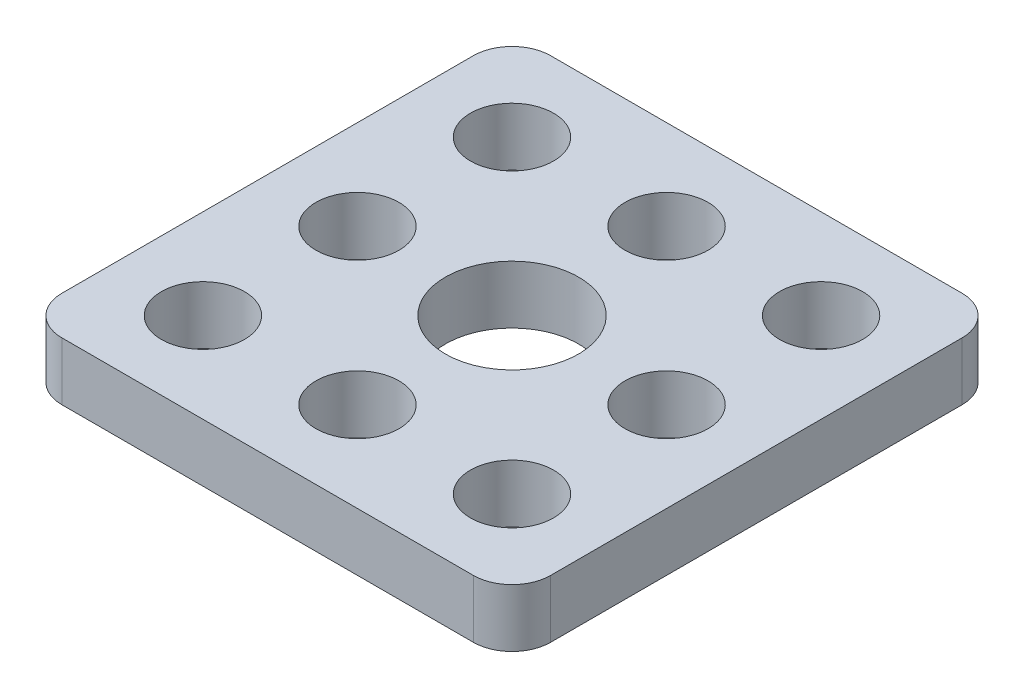
ISO-10303-21;
HEADER;
FILE_DESCRIPTION(('STEP AP214'),'2;1');
FILE_NAME('part.step','',(''),(''),'','','');
FILE_SCHEMA(('AUTOMOTIVE_DESIGN { 1 0 10303 214 1 1 1 1 }'));
ENDSEC;
DATA;
#1=APPLICATION_CONTEXT('core data for automotive mechanical design processes');
#2=APPLICATION_PROTOCOL_DEFINITION('international standard','automotive_design',2000,#1);
#3=PRODUCT_CONTEXT('',#1,'mechanical');
#4=PRODUCT('Part','Part','',(#3));
#5=PRODUCT_RELATED_PRODUCT_CATEGORY('part','',(#4));
#6=PRODUCT_DEFINITION_FORMATION('','',#4);
#7=PRODUCT_DEFINITION_CONTEXT('part definition',#1,'design');
#8=PRODUCT_DEFINITION('design','',#6,#7);
#9=PRODUCT_DEFINITION_SHAPE('','',#8);
#10=(LENGTH_UNIT() NAMED_UNIT(*) SI_UNIT(.MILLI.,.METRE.));
#11=(NAMED_UNIT(*) PLANE_ANGLE_UNIT() SI_UNIT($,.RADIAN.));
#12=(NAMED_UNIT(*) SI_UNIT($,.STERADIAN.) SOLID_ANGLE_UNIT());
#13=UNCERTAINTY_MEASURE_WITH_UNIT(LENGTH_MEASURE(1.E-05),#10,'distance_accuracy_value','');
#14=(GEOMETRIC_REPRESENTATION_CONTEXT(3) GLOBAL_UNCERTAINTY_ASSIGNED_CONTEXT((#13)) GLOBAL_UNIT_ASSIGNED_CONTEXT((#10,
#11,#12)) REPRESENTATION_CONTEXT('',''));
#15=CARTESIAN_POINT('',(0.,0.,0.));
#16=DIRECTION('',(0.,0.,1.));
#17=DIRECTION('',(1.,0.,0.));
#18=AXIS2_PLACEMENT_3D('',#15,#16,#17);
#19=CARTESIAN_POINT('',(0.,3.,0.));
#20=DIRECTION('',(0.,-1.,0.));
#21=DIRECTION('',(0.,0.,-1.));
#22=AXIS2_PLACEMENT_3D('',#19,#20,#21);
#23=PLANE('',#22);
#24=DIRECTION('',(-1.,0.,0.));
#25=VECTOR('',#24,1.);
#26=CARTESIAN_POINT('',(0.,3.,-25.3));
#27=LINE('',#26,#25);
#28=CARTESIAN_POINT('',(23.3,3.,-25.3));
#29=VERTEX_POINT('',#28);
#30=CARTESIAN_POINT('',(2.,3.,-25.3));
#31=VERTEX_POINT('',#30);
#32=EDGE_CURVE('E138',#29,#31,#27,.T.);
#33=ORIENTED_EDGE('',*,*,#32,.T.);
#34=CARTESIAN_POINT('',(2.,3.,-23.3));
#35=DIRECTION('',(0.,-1.,0.));
#36=DIRECTION('',(0.,0.,-1.));
#37=AXIS2_PLACEMENT_3D('',#34,#35,#36);
#38=CIRCLE('',#37,2.);
#39=CARTESIAN_POINT('',(0.,3.,-23.3));
#40=VERTEX_POINT('',#39);
#41=EDGE_CURVE('E157',#31,#40,#38,.F.);
#42=ORIENTED_EDGE('',*,*,#41,.T.);
#43=DIRECTION('',(0.,0.,1.));
#44=VECTOR('',#43,1.);
#45=CARTESIAN_POINT('',(0.,3.,0.));
#46=LINE('',#45,#44);
#47=CARTESIAN_POINT('',(0.,3.,-2.));
#48=VERTEX_POINT('',#47);
#49=EDGE_CURVE('E121',#40,#48,#46,.T.);
#50=ORIENTED_EDGE('',*,*,#49,.T.);
#51=CARTESIAN_POINT('',(2.,3.,-2.));
#52=DIRECTION('',(0.,-1.,0.));
#53=DIRECTION('',(0.,0.,-1.));
#54=AXIS2_PLACEMENT_3D('',#51,#52,#53);
#55=CIRCLE('',#54,2.);
#56=CARTESIAN_POINT('',(2.,3.,0.));
#57=VERTEX_POINT('',#56);
#58=EDGE_CURVE('E152',#48,#57,#55,.F.);
#59=ORIENTED_EDGE('',*,*,#58,.T.);
#60=DIRECTION('',(1.,0.,0.));
#61=VECTOR('',#60,1.);
#62=CARTESIAN_POINT('',(0.,3.,0.));
#63=LINE('',#62,#61);
#64=CARTESIAN_POINT('',(23.3,3.,0.));
#65=VERTEX_POINT('',#64);
#66=EDGE_CURVE('E168',#57,#65,#63,.T.);
#67=ORIENTED_EDGE('',*,*,#66,.T.);
#68=CARTESIAN_POINT('',(23.3,3.,-2.));
#69=DIRECTION('',(0.,-1.,0.));
#70=DIRECTION('',(0.,0.,-1.));
#71=AXIS2_PLACEMENT_3D('',#68,#69,#70);
#72=CIRCLE('',#71,2.);
#73=CARTESIAN_POINT('',(25.3,3.,-2.));
#74=VERTEX_POINT('',#73);
#75=EDGE_CURVE('E57',#65,#74,#72,.F.);
#76=ORIENTED_EDGE('',*,*,#75,.T.);
#77=DIRECTION('',(0.,0.,-1.));
#78=VECTOR('',#77,1.);
#79=CARTESIAN_POINT('',(25.3,3.,0.));
#80=LINE('',#79,#78);
#81=CARTESIAN_POINT('',(25.3,3.,-23.3));
#82=VERTEX_POINT('',#81);
#83=EDGE_CURVE('E176',#74,#82,#80,.T.);
#84=ORIENTED_EDGE('',*,*,#83,.T.);
#85=CARTESIAN_POINT('',(23.3,3.,-23.3));
#86=DIRECTION('',(0.,-1.,0.));
#87=DIRECTION('',(0.,0.,-1.));
#88=AXIS2_PLACEMENT_3D('',#85,#86,#87);
#89=CIRCLE('',#88,2.);
#90=EDGE_CURVE('E155',#82,#29,#89,.F.);
#91=ORIENTED_EDGE('',*,*,#90,.T.);
#92=EDGE_LOOP('',(#33,#42,#50,#59,#67,#76,#84,#91));
#93=FACE_BOUND('',#92,.T.);
#94=CARTESIAN_POINT('',(4.65,3.,-4.65));
#95=DIRECTION('',(0.,1.,0.));
#96=DIRECTION('',(0.,0.,1.));
#97=AXIS2_PLACEMENT_3D('',#94,#95,#96);
#98=CIRCLE('',#97,2.15);
#99=CARTESIAN_POINT('',(4.65,3.,-2.5));
#100=VERTEX_POINT('',#99);
#101=EDGE_CURVE('E129',#100,#100,#98,.T.);
#102=ORIENTED_EDGE('',*,*,#101,.F.);
#103=EDGE_LOOP('',(#102));
#104=FACE_BOUND('',#103,.T.);
#105=CARTESIAN_POINT('',(12.65,3.,-4.65));
#106=DIRECTION('',(0.,1.,0.));
#107=DIRECTION('',(0.,0.,1.));
#108=AXIS2_PLACEMENT_3D('',#105,#106,#107);
#109=CIRCLE('',#108,2.15);
#110=CARTESIAN_POINT('',(12.65,3.,-2.5));
#111=VERTEX_POINT('',#110);
#112=EDGE_CURVE('E183',#111,#111,#109,.T.);
#113=ORIENTED_EDGE('',*,*,#112,.F.);
#114=EDGE_LOOP('',(#113));
#115=FACE_BOUND('',#114,.T.);
#116=CARTESIAN_POINT('',(20.65,3.,-4.65));
#117=DIRECTION('',(0.,1.,0.));
#118=DIRECTION('',(0.,0.,1.));
#119=AXIS2_PLACEMENT_3D('',#116,#117,#118);
#120=CIRCLE('',#119,2.15);
#121=CARTESIAN_POINT('',(20.65,3.,-2.5));
#122=VERTEX_POINT('',#121);
#123=EDGE_CURVE('E188',#122,#122,#120,.T.);
#124=ORIENTED_EDGE('',*,*,#123,.F.);
#125=EDGE_LOOP('',(#124));
#126=FACE_BOUND('',#125,.T.);
#127=CARTESIAN_POINT('',(4.65,3.,-12.65));
#128=DIRECTION('',(0.,1.,0.));
#129=DIRECTION('',(0.,0.,1.));
#130=AXIS2_PLACEMENT_3D('',#127,#128,#129);
#131=CIRCLE('',#130,2.15);
#132=CARTESIAN_POINT('',(4.65,3.,-10.5));
#133=VERTEX_POINT('',#132);
#134=EDGE_CURVE('E194',#133,#133,#131,.T.);
#135=ORIENTED_EDGE('',*,*,#134,.F.);
#136=EDGE_LOOP('',(#135));
#137=FACE_BOUND('',#136,.T.);
#138=CARTESIAN_POINT('',(4.65,3.,-20.65));
#139=DIRECTION('',(0.,1.,0.));
#140=DIRECTION('',(0.,0.,1.));
#141=AXIS2_PLACEMENT_3D('',#138,#139,#140);
#142=CIRCLE('',#141,2.15);
#143=CARTESIAN_POINT('',(4.65,3.,-18.5));
#144=VERTEX_POINT('',#143);
#145=EDGE_CURVE('E200',#144,#144,#142,.T.);
#146=ORIENTED_EDGE('',*,*,#145,.F.);
#147=EDGE_LOOP('',(#146));
#148=FACE_BOUND('',#147,.T.);
#149=CARTESIAN_POINT('',(20.65,3.,-12.65));
#150=DIRECTION('',(0.,1.,0.));
#151=DIRECTION('',(0.,0.,1.));
#152=AXIS2_PLACEMENT_3D('',#149,#150,#151);
#153=CIRCLE('',#152,2.15);
#154=CARTESIAN_POINT('',(20.65,3.,-10.5));
#155=VERTEX_POINT('',#154);
#156=EDGE_CURVE('E206',#155,#155,#153,.T.);
#157=ORIENTED_EDGE('',*,*,#156,.F.);
#158=EDGE_LOOP('',(#157));
#159=FACE_BOUND('',#158,.T.);
#160=CARTESIAN_POINT('',(20.65,3.,-20.65));
#161=DIRECTION('',(0.,1.,0.));
#162=DIRECTION('',(0.,0.,1.));
#163=AXIS2_PLACEMENT_3D('',#160,#161,#162);
#164=CIRCLE('',#163,2.15);
#165=CARTESIAN_POINT('',(20.65,3.,-18.5));
#166=VERTEX_POINT('',#165);
#167=EDGE_CURVE('E212',#166,#166,#164,.T.);
#168=ORIENTED_EDGE('',*,*,#167,.F.);
#169=EDGE_LOOP('',(#168));
#170=FACE_BOUND('',#169,.T.);
#171=CARTESIAN_POINT('',(12.65,3.,-20.65));
#172=DIRECTION('',(0.,1.,0.));
#173=DIRECTION('',(0.,0.,1.));
#174=AXIS2_PLACEMENT_3D('',#171,#172,#173);
#175=CIRCLE('',#174,2.15);
#176=CARTESIAN_POINT('',(12.65,3.,-18.5));
#177=VERTEX_POINT('',#176);
#178=EDGE_CURVE('E218',#177,#177,#175,.T.);
#179=ORIENTED_EDGE('',*,*,#178,.F.);
#180=EDGE_LOOP('',(#179));
#181=FACE_BOUND('',#180,.T.);
#182=CARTESIAN_POINT('',(12.65,3.,-12.65));
#183=DIRECTION('',(0.,1.,0.));
#184=DIRECTION('',(0.,0.,1.));
#185=AXIS2_PLACEMENT_3D('',#182,#183,#184);
#186=CIRCLE('',#185,3.45);
#187=CARTESIAN_POINT('',(12.65,3.,-9.2));
#188=VERTEX_POINT('',#187);
#189=EDGE_CURVE('E224',#188,#188,#186,.T.);
#190=ORIENTED_EDGE('',*,*,#189,.F.);
#191=EDGE_LOOP('',(#190));
#192=FACE_BOUND('',#191,.T.);
#193=ADVANCED_FACE('F35',(#93,#104,#115,#126,#137,#148,#159,#170,#181,#192),#23,.F.);
#194=CARTESIAN_POINT('',(0.,0.,0.));
#195=DIRECTION('',(0.,-1.,0.));
#196=DIRECTION('',(0.,0.,-1.));
#197=AXIS2_PLACEMENT_3D('',#194,#195,#196);
#198=PLANE('',#197);
#199=CARTESIAN_POINT('',(12.65,0.,-20.65));
#200=DIRECTION('',(0.,1.,0.));
#201=DIRECTION('',(0.,0.,1.));
#202=AXIS2_PLACEMENT_3D('',#199,#200,#201);
#203=CIRCLE('',#202,2.15);
#204=CARTESIAN_POINT('',(12.65,0.,-18.5));
#205=VERTEX_POINT('',#204);
#206=EDGE_CURVE('E221',#205,#205,#203,.T.);
#207=ORIENTED_EDGE('',*,*,#206,.T.);
#208=EDGE_LOOP('',(#207));
#209=FACE_BOUND('',#208,.T.);
#210=CARTESIAN_POINT('',(20.65,0.,-12.65));
#211=DIRECTION('',(0.,1.,0.));
#212=DIRECTION('',(0.,0.,1.));
#213=AXIS2_PLACEMENT_3D('',#210,#211,#212);
#214=CIRCLE('',#213,2.15);
#215=CARTESIAN_POINT('',(20.65,0.,-10.5));
#216=VERTEX_POINT('',#215);
#217=EDGE_CURVE('E209',#216,#216,#214,.T.);
#218=ORIENTED_EDGE('',*,*,#217,.T.);
#219=EDGE_LOOP('',(#218));
#220=FACE_BOUND('',#219,.T.);
#221=CARTESIAN_POINT('',(4.65,0.,-12.65));
#222=DIRECTION('',(0.,1.,0.));
#223=DIRECTION('',(0.,0.,1.));
#224=AXIS2_PLACEMENT_3D('',#221,#222,#223);
#225=CIRCLE('',#224,2.15);
#226=CARTESIAN_POINT('',(4.65,0.,-10.5));
#227=VERTEX_POINT('',#226);
#228=EDGE_CURVE('E197',#227,#227,#225,.T.);
#229=ORIENTED_EDGE('',*,*,#228,.T.);
#230=EDGE_LOOP('',(#229));
#231=FACE_BOUND('',#230,.T.);
#232=CARTESIAN_POINT('',(12.65,0.,-4.65));
#233=DIRECTION('',(0.,1.,0.));
#234=DIRECTION('',(0.,0.,1.));
#235=AXIS2_PLACEMENT_3D('',#232,#233,#234);
#236=CIRCLE('',#235,2.15);
#237=CARTESIAN_POINT('',(12.65,0.,-2.5));
#238=VERTEX_POINT('',#237);
#239=EDGE_CURVE('E185',#238,#238,#236,.T.);
#240=ORIENTED_EDGE('',*,*,#239,.T.);
#241=EDGE_LOOP('',(#240));
#242=FACE_BOUND('',#241,.T.);
#243=DIRECTION('',(0.,0.,1.));
#244=VECTOR('',#243,1.);
#245=CARTESIAN_POINT('',(0.,0.,0.));
#246=LINE('',#245,#244);
#247=CARTESIAN_POINT('',(0.,0.,-23.3));
#248=VERTEX_POINT('',#247);
#249=CARTESIAN_POINT('',(0.,0.,-2.));
#250=VERTEX_POINT('',#249);
#251=EDGE_CURVE('E118',#248,#250,#246,.T.);
#252=ORIENTED_EDGE('',*,*,#251,.F.);
#253=CARTESIAN_POINT('',(2.,0.,-23.3));
#254=DIRECTION('',(0.,-1.,0.));
#255=DIRECTION('',(0.,0.,-1.));
#256=AXIS2_PLACEMENT_3D('',#253,#254,#255);
#257=CIRCLE('',#256,2.);
#258=CARTESIAN_POINT('',(2.,0.,-25.3));
#259=VERTEX_POINT('',#258);
#260=EDGE_CURVE('E101',#248,#259,#257,.T.);
#261=ORIENTED_EDGE('',*,*,#260,.T.);
#262=DIRECTION('',(-1.,0.,0.));
#263=VECTOR('',#262,1.);
#264=CARTESIAN_POINT('',(0.,0.,-25.3));
#265=LINE('',#264,#263);
#266=CARTESIAN_POINT('',(23.3,0.,-25.3));
#267=VERTEX_POINT('',#266);
#268=EDGE_CURVE('E142',#267,#259,#265,.T.);
#269=ORIENTED_EDGE('',*,*,#268,.F.);
#270=CARTESIAN_POINT('',(23.3,0.,-23.3));
#271=DIRECTION('',(0.,-1.,0.));
#272=DIRECTION('',(0.,0.,-1.));
#273=AXIS2_PLACEMENT_3D('',#270,#271,#272);
#274=CIRCLE('',#273,2.);
#275=CARTESIAN_POINT('',(25.3,0.,-23.3));
#276=VERTEX_POINT('',#275);
#277=EDGE_CURVE('E112',#267,#276,#274,.T.);
#278=ORIENTED_EDGE('',*,*,#277,.T.);
#279=DIRECTION('',(0.,0.,-1.));
#280=VECTOR('',#279,1.);
#281=CARTESIAN_POINT('',(25.3,0.,0.));
#282=LINE('',#281,#280);
#283=CARTESIAN_POINT('',(25.3,0.,-2.));
#284=VERTEX_POINT('',#283);
#285=EDGE_CURVE('E132',#284,#276,#282,.T.);
#286=ORIENTED_EDGE('',*,*,#285,.F.);
#287=CARTESIAN_POINT('',(23.3,0.,-2.));
#288=DIRECTION('',(0.,-1.,0.));
#289=DIRECTION('',(0.,0.,-1.));
#290=AXIS2_PLACEMENT_3D('',#287,#288,#289);
#291=CIRCLE('',#290,2.);
#292=CARTESIAN_POINT('',(23.3,0.,0.));
#293=VERTEX_POINT('',#292);
#294=EDGE_CURVE('E146',#284,#293,#291,.T.);
#295=ORIENTED_EDGE('',*,*,#294,.T.);
#296=DIRECTION('',(1.,0.,0.));
#297=VECTOR('',#296,1.);
#298=CARTESIAN_POINT('',(0.,0.,0.));
#299=LINE('',#298,#297);
#300=CARTESIAN_POINT('',(2.,0.,0.));
#301=VERTEX_POINT('',#300);
#302=EDGE_CURVE('E128',#301,#293,#299,.T.);
#303=ORIENTED_EDGE('',*,*,#302,.F.);
#304=CARTESIAN_POINT('',(2.,0.,-2.));
#305=DIRECTION('',(0.,-1.,0.));
#306=DIRECTION('',(0.,0.,-1.));
#307=AXIS2_PLACEMENT_3D('',#304,#305,#306);
#308=CIRCLE('',#307,2.);
#309=EDGE_CURVE('E122',#301,#250,#308,.T.);
#310=ORIENTED_EDGE('',*,*,#309,.T.);
#311=EDGE_LOOP('',(#252,#261,#269,#278,#286,#295,#303,#310));
#312=FACE_BOUND('',#311,.T.);
#313=CARTESIAN_POINT('',(4.65,0.,-4.65));
#314=DIRECTION('',(0.,1.,0.));
#315=DIRECTION('',(0.,0.,1.));
#316=AXIS2_PLACEMENT_3D('',#313,#314,#315);
#317=CIRCLE('',#316,2.15);
#318=CARTESIAN_POINT('',(4.65,0.,-2.5));
#319=VERTEX_POINT('',#318);
#320=EDGE_CURVE('E135',#319,#319,#317,.T.);
#321=ORIENTED_EDGE('',*,*,#320,.T.);
#322=EDGE_LOOP('',(#321));
#323=FACE_BOUND('',#322,.T.);
#324=CARTESIAN_POINT('',(20.65,0.,-4.65));
#325=DIRECTION('',(0.,1.,0.));
#326=DIRECTION('',(0.,0.,1.));
#327=AXIS2_PLACEMENT_3D('',#324,#325,#326);
#328=CIRCLE('',#327,2.15);
#329=CARTESIAN_POINT('',(20.65,0.,-2.5));
#330=VERTEX_POINT('',#329);
#331=EDGE_CURVE('E191',#330,#330,#328,.T.);
#332=ORIENTED_EDGE('',*,*,#331,.T.);
#333=EDGE_LOOP('',(#332));
#334=FACE_BOUND('',#333,.T.);
#335=CARTESIAN_POINT('',(4.65,0.,-20.65));
#336=DIRECTION('',(0.,1.,0.));
#337=DIRECTION('',(0.,0.,1.));
#338=AXIS2_PLACEMENT_3D('',#335,#336,#337);
#339=CIRCLE('',#338,2.15);
#340=CARTESIAN_POINT('',(4.65,0.,-18.5));
#341=VERTEX_POINT('',#340);
#342=EDGE_CURVE('E203',#341,#341,#339,.T.);
#343=ORIENTED_EDGE('',*,*,#342,.T.);
#344=EDGE_LOOP('',(#343));
#345=FACE_BOUND('',#344,.T.);
#346=CARTESIAN_POINT('',(20.65,0.,-20.65));
#347=DIRECTION('',(0.,1.,0.));
#348=DIRECTION('',(0.,0.,1.));
#349=AXIS2_PLACEMENT_3D('',#346,#347,#348);
#350=CIRCLE('',#349,2.15);
#351=CARTESIAN_POINT('',(20.65,0.,-18.5));
#352=VERTEX_POINT('',#351);
#353=EDGE_CURVE('E215',#352,#352,#350,.T.);
#354=ORIENTED_EDGE('',*,*,#353,.T.);
#355=EDGE_LOOP('',(#354));
#356=FACE_BOUND('',#355,.T.);
#357=CARTESIAN_POINT('',(12.65,0.,-12.65));
#358=DIRECTION('',(0.,1.,0.));
#359=DIRECTION('',(0.,0.,1.));
#360=AXIS2_PLACEMENT_3D('',#357,#358,#359);
#361=CIRCLE('',#360,3.45);
#362=CARTESIAN_POINT('',(12.65,0.,-9.2));
#363=VERTEX_POINT('',#362);
#364=EDGE_CURVE('E227',#363,#363,#361,.T.);
#365=ORIENTED_EDGE('',*,*,#364,.T.);
#366=EDGE_LOOP('',(#365));
#367=FACE_BOUND('',#366,.T.);
#368=ADVANCED_FACE('F125',(#209,#220,#231,#242,#312,#323,#334,#345,#356,#367),#198,.T.);
#369=CARTESIAN_POINT('',(0.,3.,0.));
#370=DIRECTION('',(1.,0.,0.));
#371=DIRECTION('',(0.,0.,-1.));
#372=AXIS2_PLACEMENT_3D('',#369,#370,#371);
#373=PLANE('',#372);
#374=ORIENTED_EDGE('',*,*,#49,.F.);
#375=DIRECTION('',(0.,-1.,0.));
#376=VECTOR('',#375,1.);
#377=CARTESIAN_POINT('',(0.,3.,-23.3));
#378=LINE('',#377,#376);
#379=EDGE_CURVE('E105',#40,#248,#378,.T.);
#380=ORIENTED_EDGE('',*,*,#379,.T.);
#381=ORIENTED_EDGE('',*,*,#251,.T.);
#382=DIRECTION('',(0.,-1.,0.));
#383=VECTOR('',#382,1.);
#384=CARTESIAN_POINT('',(0.,3.,-2.));
#385=LINE('',#384,#383);
#386=EDGE_CURVE('E123',#250,#48,#385,.F.);
#387=ORIENTED_EDGE('',*,*,#386,.T.);
#388=EDGE_LOOP('',(#374,#380,#381,#387));
#389=FACE_BOUND('',#388,.T.);
#390=ADVANCED_FACE('F117',(#389),#373,.F.);
#391=CARTESIAN_POINT('',(0.,3.,0.));
#392=DIRECTION('',(0.,0.,-1.));
#393=DIRECTION('',(-1.,0.,0.));
#394=AXIS2_PLACEMENT_3D('',#391,#392,#393);
#395=PLANE('',#394);
#396=ORIENTED_EDGE('',*,*,#302,.T.);
#397=DIRECTION('',(0.,-1.,0.));
#398=VECTOR('',#397,1.);
#399=CARTESIAN_POINT('',(23.3,3.,0.));
#400=LINE('',#399,#398);
#401=EDGE_CURVE('E11',#293,#65,#400,.F.);
#402=ORIENTED_EDGE('',*,*,#401,.T.);
#403=ORIENTED_EDGE('',*,*,#66,.F.);
#404=DIRECTION('',(0.,-1.,0.));
#405=VECTOR('',#404,1.);
#406=CARTESIAN_POINT('',(2.,3.,0.));
#407=LINE('',#406,#405);
#408=EDGE_CURVE('E43',#57,#301,#407,.T.);
#409=ORIENTED_EDGE('',*,*,#408,.T.);
#410=EDGE_LOOP('',(#396,#402,#403,#409));
#411=FACE_BOUND('',#410,.T.);
#412=ADVANCED_FACE('F166',(#411),#395,.F.);
#413=CARTESIAN_POINT('',(25.3,3.,0.));
#414=DIRECTION('',(-1.,0.,0.));
#415=DIRECTION('',(0.,0.,1.));
#416=AXIS2_PLACEMENT_3D('',#413,#414,#415);
#417=PLANE('',#416);
#418=ORIENTED_EDGE('',*,*,#285,.T.);
#419=DIRECTION('',(0.,-1.,0.));
#420=VECTOR('',#419,1.);
#421=CARTESIAN_POINT('',(25.3,3.,-23.3));
#422=LINE('',#421,#420);
#423=EDGE_CURVE('E50',#276,#82,#422,.F.);
#424=ORIENTED_EDGE('',*,*,#423,.T.);
#425=ORIENTED_EDGE('',*,*,#83,.F.);
#426=DIRECTION('',(0.,-1.,0.));
#427=VECTOR('',#426,1.);
#428=CARTESIAN_POINT('',(25.3,3.,-2.));
#429=LINE('',#428,#427);
#430=EDGE_CURVE('E159',#74,#284,#429,.T.);
#431=ORIENTED_EDGE('',*,*,#430,.T.);
#432=EDGE_LOOP('',(#418,#424,#425,#431));
#433=FACE_BOUND('',#432,.T.);
#434=ADVANCED_FACE('F175',(#433),#417,.F.);
#435=CARTESIAN_POINT('',(0.,3.,-25.3));
#436=DIRECTION('',(0.,0.,1.));
#437=DIRECTION('',(1.,0.,0.));
#438=AXIS2_PLACEMENT_3D('',#435,#436,#437);
#439=PLANE('',#438);
#440=ORIENTED_EDGE('',*,*,#268,.T.);
#441=DIRECTION('',(0.,-1.,0.));
#442=VECTOR('',#441,1.);
#443=CARTESIAN_POINT('',(2.,3.,-25.3));
#444=LINE('',#443,#442);
#445=EDGE_CURVE('E106',#259,#31,#444,.F.);
#446=ORIENTED_EDGE('',*,*,#445,.T.);
#447=ORIENTED_EDGE('',*,*,#32,.F.);
#448=DIRECTION('',(0.,-1.,0.));
#449=VECTOR('',#448,1.);
#450=CARTESIAN_POINT('',(23.3,3.,-25.3));
#451=LINE('',#450,#449);
#452=EDGE_CURVE('E111',#29,#267,#451,.T.);
#453=ORIENTED_EDGE('',*,*,#452,.T.);
#454=EDGE_LOOP('',(#440,#446,#447,#453));
#455=FACE_BOUND('',#454,.T.);
#456=ADVANCED_FACE('F248',(#455),#439,.F.);
#457=CARTESIAN_POINT('',(4.65,3.,-4.65));
#458=DIRECTION('',(0.,-1.,0.));
#459=DIRECTION('',(0.,0.,-1.));
#460=AXIS2_PLACEMENT_3D('',#457,#458,#459);
#461=CYLINDRICAL_SURFACE('',#460,2.15);
#462=ORIENTED_EDGE('',*,*,#101,.T.);
#463=EDGE_LOOP('',(#462));
#464=FACE_BOUND('',#463,.T.);
#465=ORIENTED_EDGE('',*,*,#320,.F.);
#466=EDGE_LOOP('',(#465));
#467=FACE_BOUND('',#466,.T.);
#468=ADVANCED_FACE('F245',(#464,#467),#461,.F.);
#469=CARTESIAN_POINT('',(12.65,3.,-4.65));
#470=DIRECTION('',(0.,-1.,0.));
#471=DIRECTION('',(0.,0.,-1.));
#472=AXIS2_PLACEMENT_3D('',#469,#470,#471);
#473=CYLINDRICAL_SURFACE('',#472,2.15);
#474=ORIENTED_EDGE('',*,*,#112,.T.);
#475=EDGE_LOOP('',(#474));
#476=FACE_BOUND('',#475,.T.);
#477=ORIENTED_EDGE('',*,*,#239,.F.);
#478=EDGE_LOOP('',(#477));
#479=FACE_BOUND('',#478,.T.);
#480=ADVANCED_FACE('F391',(#476,#479),#473,.F.);
#481=CARTESIAN_POINT('',(20.65,3.,-4.65));
#482=DIRECTION('',(0.,-1.,0.));
#483=DIRECTION('',(0.,0.,-1.));
#484=AXIS2_PLACEMENT_3D('',#481,#482,#483);
#485=CYLINDRICAL_SURFACE('',#484,2.15);
#486=ORIENTED_EDGE('',*,*,#123,.T.);
#487=EDGE_LOOP('',(#486));
#488=FACE_BOUND('',#487,.T.);
#489=ORIENTED_EDGE('',*,*,#331,.F.);
#490=EDGE_LOOP('',(#489));
#491=FACE_BOUND('',#490,.T.);
#492=ADVANCED_FACE('F381',(#488,#491),#485,.F.);
#493=CARTESIAN_POINT('',(4.65,3.,-12.65));
#494=DIRECTION('',(0.,-1.,0.));
#495=DIRECTION('',(0.,0.,-1.));
#496=AXIS2_PLACEMENT_3D('',#493,#494,#495);
#497=CYLINDRICAL_SURFACE('',#496,2.15);
#498=ORIENTED_EDGE('',*,*,#134,.T.);
#499=EDGE_LOOP('',(#498));
#500=FACE_BOUND('',#499,.T.);
#501=ORIENTED_EDGE('',*,*,#228,.F.);
#502=EDGE_LOOP('',(#501));
#503=FACE_BOUND('',#502,.T.);
#504=ADVANCED_FACE('F371',(#500,#503),#497,.F.);
#505=CARTESIAN_POINT('',(4.65,3.,-20.65));
#506=DIRECTION('',(0.,-1.,0.));
#507=DIRECTION('',(0.,0.,-1.));
#508=AXIS2_PLACEMENT_3D('',#505,#506,#507);
#509=CYLINDRICAL_SURFACE('',#508,2.15);
#510=ORIENTED_EDGE('',*,*,#145,.T.);
#511=EDGE_LOOP('',(#510));
#512=FACE_BOUND('',#511,.T.);
#513=ORIENTED_EDGE('',*,*,#342,.F.);
#514=EDGE_LOOP('',(#513));
#515=FACE_BOUND('',#514,.T.);
#516=ADVANCED_FACE('F361',(#512,#515),#509,.F.);
#517=CARTESIAN_POINT('',(20.65,3.,-12.65));
#518=DIRECTION('',(0.,-1.,0.));
#519=DIRECTION('',(0.,0.,-1.));
#520=AXIS2_PLACEMENT_3D('',#517,#518,#519);
#521=CYLINDRICAL_SURFACE('',#520,2.15);
#522=ORIENTED_EDGE('',*,*,#156,.T.);
#523=EDGE_LOOP('',(#522));
#524=FACE_BOUND('',#523,.T.);
#525=ORIENTED_EDGE('',*,*,#217,.F.);
#526=EDGE_LOOP('',(#525));
#527=FACE_BOUND('',#526,.T.);
#528=ADVANCED_FACE('F351',(#524,#527),#521,.F.);
#529=CARTESIAN_POINT('',(20.65,3.,-20.65));
#530=DIRECTION('',(0.,-1.,0.));
#531=DIRECTION('',(0.,0.,-1.));
#532=AXIS2_PLACEMENT_3D('',#529,#530,#531);
#533=CYLINDRICAL_SURFACE('',#532,2.15);
#534=ORIENTED_EDGE('',*,*,#167,.T.);
#535=EDGE_LOOP('',(#534));
#536=FACE_BOUND('',#535,.T.);
#537=ORIENTED_EDGE('',*,*,#353,.F.);
#538=EDGE_LOOP('',(#537));
#539=FACE_BOUND('',#538,.T.);
#540=ADVANCED_FACE('F341',(#536,#539),#533,.F.);
#541=CARTESIAN_POINT('',(12.65,3.,-20.65));
#542=DIRECTION('',(0.,-1.,0.));
#543=DIRECTION('',(0.,0.,-1.));
#544=AXIS2_PLACEMENT_3D('',#541,#542,#543);
#545=CYLINDRICAL_SURFACE('',#544,2.15);
#546=ORIENTED_EDGE('',*,*,#178,.T.);
#547=EDGE_LOOP('',(#546));
#548=FACE_BOUND('',#547,.T.);
#549=ORIENTED_EDGE('',*,*,#206,.F.);
#550=EDGE_LOOP('',(#549));
#551=FACE_BOUND('',#550,.T.);
#552=ADVANCED_FACE('F332',(#548,#551),#545,.F.);
#553=CARTESIAN_POINT('',(12.65,3.,-12.65));
#554=DIRECTION('',(0.,-1.,0.));
#555=DIRECTION('',(0.,0.,-1.));
#556=AXIS2_PLACEMENT_3D('',#553,#554,#555);
#557=CYLINDRICAL_SURFACE('',#556,3.45);
#558=ORIENTED_EDGE('',*,*,#189,.T.);
#559=EDGE_LOOP('',(#558));
#560=FACE_BOUND('',#559,.T.);
#561=ORIENTED_EDGE('',*,*,#364,.F.);
#562=EDGE_LOOP('',(#561));
#563=FACE_BOUND('',#562,.T.);
#564=ADVANCED_FACE('F233',(#560,#563),#557,.F.);
#565=CARTESIAN_POINT('',(2.,3.,-23.3));
#566=DIRECTION('',(0.,-1.,0.));
#567=DIRECTION('',(0.,0.,-1.));
#568=AXIS2_PLACEMENT_3D('',#565,#566,#567);
#569=CYLINDRICAL_SURFACE('',#568,2.);
#570=ORIENTED_EDGE('',*,*,#41,.F.);
#571=ORIENTED_EDGE('',*,*,#445,.F.);
#572=ORIENTED_EDGE('',*,*,#260,.F.);
#573=ORIENTED_EDGE('',*,*,#379,.F.);
#574=EDGE_LOOP('',(#570,#571,#572,#573));
#575=FACE_BOUND('',#574,.T.);
#576=ADVANCED_FACE('F104',(#575),#569,.T.);
#577=CARTESIAN_POINT('',(23.3,3.,-23.3));
#578=DIRECTION('',(0.,-1.,0.));
#579=DIRECTION('',(0.,0.,-1.));
#580=AXIS2_PLACEMENT_3D('',#577,#578,#579);
#581=CYLINDRICAL_SURFACE('',#580,2.);
#582=ORIENTED_EDGE('',*,*,#90,.F.);
#583=ORIENTED_EDGE('',*,*,#423,.F.);
#584=ORIENTED_EDGE('',*,*,#277,.F.);
#585=ORIENTED_EDGE('',*,*,#452,.F.);
#586=EDGE_LOOP('',(#582,#583,#584,#585));
#587=FACE_BOUND('',#586,.T.);
#588=ADVANCED_FACE('F260',(#587),#581,.T.);
#589=CARTESIAN_POINT('',(23.3,3.,-2.));
#590=DIRECTION('',(0.,-1.,0.));
#591=DIRECTION('',(0.,0.,-1.));
#592=AXIS2_PLACEMENT_3D('',#589,#590,#591);
#593=CYLINDRICAL_SURFACE('',#592,2.);
#594=ORIENTED_EDGE('',*,*,#75,.F.);
#595=ORIENTED_EDGE('',*,*,#401,.F.);
#596=ORIENTED_EDGE('',*,*,#294,.F.);
#597=ORIENTED_EDGE('',*,*,#430,.F.);
#598=EDGE_LOOP('',(#594,#595,#596,#597));
#599=FACE_BOUND('',#598,.T.);
#600=ADVANCED_FACE('F174',(#599),#593,.T.);
#601=CARTESIAN_POINT('',(2.,3.,-2.));
#602=DIRECTION('',(0.,-1.,0.));
#603=DIRECTION('',(0.,0.,-1.));
#604=AXIS2_PLACEMENT_3D('',#601,#602,#603);
#605=CYLINDRICAL_SURFACE('',#604,2.);
#606=ORIENTED_EDGE('',*,*,#58,.F.);
#607=ORIENTED_EDGE('',*,*,#386,.F.);
#608=ORIENTED_EDGE('',*,*,#309,.F.);
#609=ORIENTED_EDGE('',*,*,#408,.F.);
#610=EDGE_LOOP('',(#606,#607,#608,#609));
#611=FACE_BOUND('',#610,.T.);
#612=ADVANCED_FACE('F37',(#611),#605,.T.);
#613=CLOSED_SHELL('',(#193,#368,#390,#412,#434,#456,#468,#480,#492,#504,#516,#528,#540,#552,
#564,#576,#588,#600,#612));
#614=MANIFOLD_SOLID_BREP('B2',#613);
#615=ADVANCED_BREP_SHAPE_REPRESENTATION('',(#18,#614),#14);
#616=SHAPE_DEFINITION_REPRESENTATION(#9,#615);
ENDSEC;
END-ISO-10303-21;
